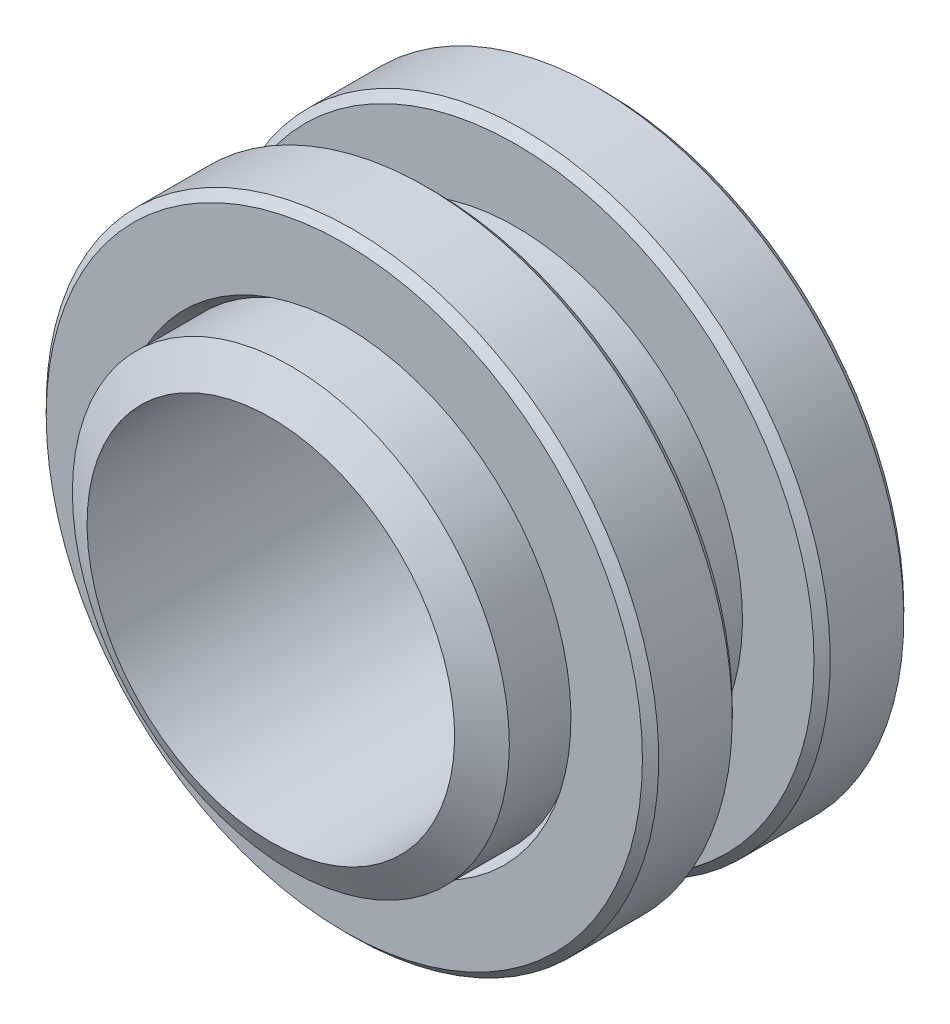
ISO-10303-21;
HEADER;
FILE_DESCRIPTION(('STEP AP214'),'2;1');
FILE_NAME('part.step','',(''),(''),'','','');
FILE_SCHEMA(('AUTOMOTIVE_DESIGN { 1 0 10303 214 1 1 1 1 }'));
ENDSEC;
DATA;
#1=APPLICATION_CONTEXT('core data for automotive mechanical design processes');
#2=APPLICATION_PROTOCOL_DEFINITION('international standard','automotive_design',2000,#1);
#3=PRODUCT_CONTEXT('',#1,'mechanical');
#4=PRODUCT('Part','Part','',(#3));
#5=PRODUCT_RELATED_PRODUCT_CATEGORY('part','',(#4));
#6=PRODUCT_DEFINITION_FORMATION('','',#4);
#7=PRODUCT_DEFINITION_CONTEXT('part definition',#1,'design');
#8=PRODUCT_DEFINITION('design','',#6,#7);
#9=PRODUCT_DEFINITION_SHAPE('','',#8);
#10=(LENGTH_UNIT() NAMED_UNIT(*) SI_UNIT(.MILLI.,.METRE.));
#11=(NAMED_UNIT(*) PLANE_ANGLE_UNIT() SI_UNIT($,.RADIAN.));
#12=(NAMED_UNIT(*) SI_UNIT($,.STERADIAN.) SOLID_ANGLE_UNIT());
#13=UNCERTAINTY_MEASURE_WITH_UNIT(LENGTH_MEASURE(1.E-05),#10,'distance_accuracy_value','');
#14=(GEOMETRIC_REPRESENTATION_CONTEXT(3) GLOBAL_UNCERTAINTY_ASSIGNED_CONTEXT((#13)) GLOBAL_UNIT_ASSIGNED_CONTEXT((#10,
#11,#12)) REPRESENTATION_CONTEXT('',''));
#15=CARTESIAN_POINT('',(0.,0.,0.));
#16=DIRECTION('',(0.,0.,1.));
#17=DIRECTION('',(1.,0.,0.));
#18=AXIS2_PLACEMENT_3D('',#15,#16,#17);
#19=CARTESIAN_POINT('',(0.,0.,1.6627503844098));
#20=DIRECTION('',(0.,0.,-1.));
#21=DIRECTION('',(0.,1.,0.));
#22=AXIS2_PLACEMENT_3D('',#19,#20,#21);
#23=CONICAL_SURFACE('',#22,6.7945,1.0471975511966);
#24=CARTESIAN_POINT('',(0.,0.,2.286));
#25=DIRECTION('',(0.,0.,1.));
#26=DIRECTION('',(0.,-1.,0.));
#27=AXIS2_PLACEMENT_3D('',#24,#25,#26);
#28=CIRCLE('',#27,5.715);
#29=CARTESIAN_POINT('',(0.,-5.715,2.286));
#30=VERTEX_POINT('',#29);
#31=EDGE_CURVE('P0_E10',#30,#30,#28,.T.);
#32=ORIENTED_EDGE('',*,*,#31,.F.);
#33=EDGE_LOOP('',(#32));
#34=FACE_BOUND('',#33,.T.);
#35=CARTESIAN_POINT('',(0.,0.,1.6627503844098));
#36=DIRECTION('',(0.,0.,1.));
#37=DIRECTION('',(0.,-1.,0.));
#38=AXIS2_PLACEMENT_3D('',#35,#36,#37);
#39=CIRCLE('',#38,6.7945);
#40=CARTESIAN_POINT('',(0.,-6.7945,1.6627503844098));
#41=VERTEX_POINT('',#40);
#42=EDGE_CURVE('P0_E28',#41,#41,#39,.T.);
#43=ORIENTED_EDGE('',*,*,#42,.T.);
#44=EDGE_LOOP('',(#43));
#45=FACE_BOUND('',#44,.T.);
#46=ADVANCED_FACE('P0_F14',(#34,#45),#23,.T.);
#47=CARTESIAN_POINT('',(0.,0.,2.286));
#48=DIRECTION('',(0.,0.,1.));
#49=DIRECTION('',(0.,-1.,0.));
#50=AXIS2_PLACEMENT_3D('',#47,#48,#49);
#51=CYLINDRICAL_SURFACE('',#50,5.715);
#52=CARTESIAN_POINT('',(0.,0.,-10.414));
#53=DIRECTION('',(0.,0.,1.));
#54=DIRECTION('',(0.,-1.,0.));
#55=AXIS2_PLACEMENT_3D('',#52,#53,#54);
#56=CIRCLE('',#55,5.715);
#57=CARTESIAN_POINT('',(0.,-5.715,-10.414));
#58=VERTEX_POINT('',#57);
#59=EDGE_CURVE('P0_E20',#58,#58,#56,.T.);
#60=ORIENTED_EDGE('',*,*,#59,.F.);
#61=EDGE_LOOP('',(#60));
#62=FACE_BOUND('',#61,.T.);
#63=ORIENTED_EDGE('',*,*,#31,.T.);
#64=EDGE_LOOP('',(#63));
#65=FACE_BOUND('',#64,.T.);
#66=ADVANCED_FACE('P0_F43',(#62,#65),#51,.F.);
#67=CARTESIAN_POINT('',(0.,0.,-10.414));
#68=DIRECTION('',(0.,0.,1.));
#69=DIRECTION('',(0.,-1.,0.));
#70=AXIS2_PLACEMENT_3D('',#67,#68,#69);
#71=CONICAL_SURFACE('',#70,5.715,1.0471975511966);
#72=CARTESIAN_POINT('',(0.,0.,-9.7907503844098));
#73=DIRECTION('',(0.,0.,1.));
#74=DIRECTION('',(0.,-1.,0.));
#75=AXIS2_PLACEMENT_3D('',#72,#73,#74);
#76=CIRCLE('',#75,6.7945);
#77=CARTESIAN_POINT('',(0.,-6.7945,-9.7907503844098));
#78=VERTEX_POINT('',#77);
#79=EDGE_CURVE('P0_E24',#78,#78,#76,.T.);
#80=ORIENTED_EDGE('',*,*,#79,.F.);
#81=EDGE_LOOP('',(#80));
#82=FACE_BOUND('',#81,.T.);
#83=ORIENTED_EDGE('',*,*,#59,.T.);
#84=EDGE_LOOP('',(#83));
#85=FACE_BOUND('',#84,.T.);
#86=ADVANCED_FACE('P0_F38',(#82,#85),#71,.T.);
#87=CARTESIAN_POINT('',(0.,0.,2.286));
#88=DIRECTION('',(0.,0.,1.));
#89=DIRECTION('',(0.,-1.,0.));
#90=AXIS2_PLACEMENT_3D('',#87,#88,#89);
#91=CYLINDRICAL_SURFACE('',#90,6.7945);
#92=ORIENTED_EDGE('',*,*,#42,.F.);
#93=EDGE_LOOP('',(#92));
#94=FACE_BOUND('',#93,.T.);
#95=ORIENTED_EDGE('',*,*,#79,.T.);
#96=EDGE_LOOP('',(#95));
#97=FACE_BOUND('',#96,.T.);
#98=ADVANCED_FACE('P0_F35',(#94,#97),#91,.T.);
#99=CLOSED_SHELL('',(#46,#66,#86,#98));
#100=MANIFOLD_SOLID_BREP('P0_B1',#99);
#101=CARTESIAN_POINT('',(6.7945,0.,-2.794));
#102=DIRECTION('',(0.,0.,1.));
#103=DIRECTION('',(0.,-1.,0.));
#104=AXIS2_PLACEMENT_3D('',#101,#102,#103);
#105=PLANE('',#104);
#106=CARTESIAN_POINT('',(0.,0.,-2.794));
#107=DIRECTION('',(0.,0.,1.));
#108=DIRECTION('',(0.,-1.,0.));
#109=AXIS2_PLACEMENT_3D('',#106,#107,#108);
#110=CIRCLE('',#109,7.0485);
#111=CARTESIAN_POINT('',(0.,-7.0485,-2.794));
#112=VERTEX_POINT('',#111);
#113=EDGE_CURVE('P1_E29',#112,#112,#110,.T.);
#114=ORIENTED_EDGE('',*,*,#113,.T.);
#115=EDGE_LOOP('',(#114));
#116=FACE_BOUND('',#115,.T.);
#117=CARTESIAN_POINT('',(0.,0.,-2.794));
#118=DIRECTION('',(0.,0.,1.));
#119=DIRECTION('',(0.,-1.,0.));
#120=AXIS2_PLACEMENT_3D('',#117,#118,#119);
#121=CIRCLE('',#120,9.271);
#122=CARTESIAN_POINT('',(0.,-9.271,-2.794));
#123=VERTEX_POINT('',#122);
#124=EDGE_CURVE('P1_E37',#123,#123,#121,.F.);
#125=ORIENTED_EDGE('',*,*,#124,.T.);
#126=EDGE_LOOP('',(#125));
#127=FACE_BOUND('',#126,.T.);
#128=ADVANCED_FACE('P1_F14',(#116,#127),#105,.F.);
#129=CARTESIAN_POINT('',(0.,0.,15.6468869532938));
#130=DIRECTION('',(0.,0.,1.));
#131=DIRECTION('',(0.,-1.,0.));
#132=AXIS2_PLACEMENT_3D('',#129,#130,#131);
#133=CYLINDRICAL_SURFACE('',#132,9.525);
#134=CARTESIAN_POINT('',(0.,0.,-2.54));
#135=DIRECTION('',(0.,0.,1.));
#136=DIRECTION('',(0.,-1.,0.));
#137=AXIS2_PLACEMENT_3D('',#134,#135,#136);
#138=CIRCLE('',#137,9.525);
#139=CARTESIAN_POINT('',(0.,-9.525,-2.54));
#140=VERTEX_POINT('',#139);
#141=EDGE_CURVE('P1_E40',#140,#140,#138,.T.);
#142=ORIENTED_EDGE('',*,*,#141,.T.);
#143=EDGE_LOOP('',(#142));
#144=FACE_BOUND('',#143,.T.);
#145=CARTESIAN_POINT('',(0.,0.,-0.253999999999999));
#146=DIRECTION('',(0.,0.,-1.));
#147=DIRECTION('',(0.,1.,0.));
#148=AXIS2_PLACEMENT_3D('',#145,#146,#147);
#149=CIRCLE('',#148,9.525);
#150=CARTESIAN_POINT('',(0.,9.525,-0.253999999999999));
#151=VERTEX_POINT('',#150);
#152=EDGE_CURVE('P1_E43',#151,#151,#149,.T.);
#153=ORIENTED_EDGE('',*,*,#152,.T.);
#154=EDGE_LOOP('',(#153));
#155=FACE_BOUND('',#154,.T.);
#156=ADVANCED_FACE('P1_F47',(#144,#155),#133,.T.);
#157=CARTESIAN_POINT('',(9.525,0.,0.));
#158=DIRECTION('',(0.,0.,-1.));
#159=DIRECTION('',(0.,1.,0.));
#160=AXIS2_PLACEMENT_3D('',#157,#158,#159);
#161=PLANE('',#160);
#162=CARTESIAN_POINT('',(0.,0.,0.));
#163=DIRECTION('',(0.,0.,-1.));
#164=DIRECTION('',(0.,1.,0.));
#165=AXIS2_PLACEMENT_3D('',#162,#163,#164);
#166=CIRCLE('',#165,7.0485);
#167=CARTESIAN_POINT('',(0.,7.0485,0.));
#168=VERTEX_POINT('',#167);
#169=EDGE_CURVE('P1_E10',#168,#168,#166,.T.);
#170=ORIENTED_EDGE('',*,*,#169,.T.);
#171=EDGE_LOOP('',(#170));
#172=FACE_BOUND('',#171,.T.);
#173=CARTESIAN_POINT('',(0.,0.,0.));
#174=DIRECTION('',(0.,0.,-1.));
#175=DIRECTION('',(0.,1.,0.));
#176=AXIS2_PLACEMENT_3D('',#173,#174,#175);
#177=CIRCLE('',#176,9.271);
#178=CARTESIAN_POINT('',(0.,9.271,0.));
#179=VERTEX_POINT('',#178);
#180=EDGE_CURVE('P1_E34',#179,#179,#177,.F.);
#181=ORIENTED_EDGE('',*,*,#180,.T.);
#182=EDGE_LOOP('',(#181));
#183=FACE_BOUND('',#182,.T.);
#184=ADVANCED_FACE('P1_F57',(#172,#183),#161,.F.);
#185=CARTESIAN_POINT('',(0.,0.,15.6468869532938));
#186=DIRECTION('',(0.,0.,1.));
#187=DIRECTION('',(0.,-1.,0.));
#188=AXIS2_PLACEMENT_3D('',#185,#186,#187);
#189=CYLINDRICAL_SURFACE('',#188,6.7945);
#190=CARTESIAN_POINT('',(0.,0.,-2.3540590948775));
#191=DIRECTION('',(0.,0.,1.));
#192=DIRECTION('',(0.,-1.,0.));
#193=AXIS2_PLACEMENT_3D('',#190,#191,#192);
#194=CIRCLE('',#193,6.7945);
#195=CARTESIAN_POINT('',(0.,-6.7945,-2.3540590948775));
#196=VERTEX_POINT('',#195);
#197=EDGE_CURVE('P1_E21',#196,#196,#194,.F.);
#198=ORIENTED_EDGE('',*,*,#197,.T.);
#199=EDGE_LOOP('',(#198));
#200=FACE_BOUND('',#199,.T.);
#201=CARTESIAN_POINT('',(0.,0.,-0.439940905122503));
#202=DIRECTION('',(0.,0.,-1.));
#203=DIRECTION('',(0.,1.,0.));
#204=AXIS2_PLACEMENT_3D('',#201,#202,#203);
#205=CIRCLE('',#204,6.7945);
#206=CARTESIAN_POINT('',(0.,6.7945,-0.439940905122503));
#207=VERTEX_POINT('',#206);
#208=EDGE_CURVE('P1_E25',#207,#207,#205,.F.);
#209=ORIENTED_EDGE('',*,*,#208,.T.);
#210=EDGE_LOOP('',(#209));
#211=FACE_BOUND('',#210,.T.);
#212=ADVANCED_FACE('P1_F59',(#200,#211),#189,.F.);
#213=CARTESIAN_POINT('',(0.,0.,-2.54));
#214=DIRECTION('',(0.,0.,1.));
#215=DIRECTION('',(0.,-1.,0.));
#216=AXIS2_PLACEMENT_3D('',#213,#214,#215);
#217=CONICAL_SURFACE('',#216,9.525,0.785398163397452);
#218=ORIENTED_EDGE('',*,*,#124,.F.);
#219=EDGE_LOOP('',(#218));
#220=FACE_BOUND('',#219,.T.);
#221=ORIENTED_EDGE('',*,*,#141,.F.);
#222=EDGE_LOOP('',(#221));
#223=FACE_BOUND('',#222,.T.);
#224=ADVANCED_FACE('P1_F53',(#220,#223),#217,.T.);
#225=CARTESIAN_POINT('',(0.,0.,0.));
#226=DIRECTION('',(0.,0.,-1.));
#227=DIRECTION('',(0.,1.,0.));
#228=AXIS2_PLACEMENT_3D('',#225,#226,#227);
#229=CONICAL_SURFACE('',#228,9.271,0.785398163397452);
#230=ORIENTED_EDGE('',*,*,#152,.F.);
#231=EDGE_LOOP('',(#230));
#232=FACE_BOUND('',#231,.T.);
#233=ORIENTED_EDGE('',*,*,#180,.F.);
#234=EDGE_LOOP('',(#233));
#235=FACE_BOUND('',#234,.T.);
#236=ADVANCED_FACE('P1_F49',(#232,#235),#229,.T.);
#237=CARTESIAN_POINT('',(0.,0.,-2.794));
#238=DIRECTION('',(0.,0.,-1.));
#239=DIRECTION('',(0.,1.,0.));
#240=AXIS2_PLACEMENT_3D('',#237,#238,#239);
#241=CONICAL_SURFACE('',#240,7.0485,0.523598775598303);
#242=ORIENTED_EDGE('',*,*,#197,.F.);
#243=EDGE_LOOP('',(#242));
#244=FACE_BOUND('',#243,.T.);
#245=ORIENTED_EDGE('',*,*,#113,.F.);
#246=EDGE_LOOP('',(#245));
#247=FACE_BOUND('',#246,.T.);
#248=ADVANCED_FACE('P1_F52',(#244,#247),#241,.F.);
#249=CARTESIAN_POINT('',(0.,0.,-0.439940905122503));
#250=DIRECTION('',(0.,0.,1.));
#251=DIRECTION('',(0.,-1.,0.));
#252=AXIS2_PLACEMENT_3D('',#249,#250,#251);
#253=CONICAL_SURFACE('',#252,6.7945,0.523598775598297);
#254=ORIENTED_EDGE('',*,*,#169,.F.);
#255=EDGE_LOOP('',(#254));
#256=FACE_BOUND('',#255,.T.);
#257=ORIENTED_EDGE('',*,*,#208,.F.);
#258=EDGE_LOOP('',(#257));
#259=FACE_BOUND('',#258,.T.);
#260=ADVANCED_FACE('P1_F16',(#256,#259),#253,.F.);
#261=CLOSED_SHELL('',(#128,#156,#184,#212,#224,#236,#248,#260));
#262=MANIFOLD_SOLID_BREP('P1_B1',#261);
#263=CARTESIAN_POINT('',(-6.7945,0.,-8.128));
#264=DIRECTION('',(0.,0.,1.));
#265=DIRECTION('',(0.,1.,0.));
#266=AXIS2_PLACEMENT_3D('',#263,#264,#265);
#267=PLANE('',#266);
#268=CARTESIAN_POINT('',(0.,0.,-8.128));
#269=DIRECTION('',(0.,0.,1.));
#270=DIRECTION('',(0.,1.,0.));
#271=AXIS2_PLACEMENT_3D('',#268,#269,#270);
#272=CIRCLE('',#271,7.0485);
#273=CARTESIAN_POINT('',(0.,7.04850000000001,-8.128));
#274=VERTEX_POINT('',#273);
#275=EDGE_CURVE('P2_E29',#274,#274,#272,.T.);
#276=ORIENTED_EDGE('',*,*,#275,.T.);
#277=EDGE_LOOP('',(#276));
#278=FACE_BOUND('',#277,.T.);
#279=CARTESIAN_POINT('',(0.,0.,-8.128));
#280=DIRECTION('',(0.,0.,1.));
#281=DIRECTION('',(0.,1.,0.));
#282=AXIS2_PLACEMENT_3D('',#279,#280,#281);
#283=CIRCLE('',#282,9.271);
#284=CARTESIAN_POINT('',(0.,9.271,-8.128));
#285=VERTEX_POINT('',#284);
#286=EDGE_CURVE('P2_E37',#285,#285,#283,.F.);
#287=ORIENTED_EDGE('',*,*,#286,.T.);
#288=EDGE_LOOP('',(#287));
#289=FACE_BOUND('',#288,.T.);
#290=ADVANCED_FACE('P2_F14',(#278,#289),#267,.F.);
#291=CARTESIAN_POINT('',(0.,0.,10.3128869532938));
#292=DIRECTION('',(0.,0.,1.));
#293=DIRECTION('',(0.,1.,0.));
#294=AXIS2_PLACEMENT_3D('',#291,#292,#293);
#295=CYLINDRICAL_SURFACE('',#294,9.525);
#296=CARTESIAN_POINT('',(0.,0.,-7.874));
#297=DIRECTION('',(0.,0.,1.));
#298=DIRECTION('',(0.,1.,0.));
#299=AXIS2_PLACEMENT_3D('',#296,#297,#298);
#300=CIRCLE('',#299,9.525);
#301=CARTESIAN_POINT('',(0.,9.525,-7.874));
#302=VERTEX_POINT('',#301);
#303=EDGE_CURVE('P2_E40',#302,#302,#300,.T.);
#304=ORIENTED_EDGE('',*,*,#303,.T.);
#305=EDGE_LOOP('',(#304));
#306=FACE_BOUND('',#305,.T.);
#307=CARTESIAN_POINT('',(0.,0.,-5.588));
#308=DIRECTION('',(0.,0.,-1.));
#309=DIRECTION('',(0.,-1.,0.));
#310=AXIS2_PLACEMENT_3D('',#307,#308,#309);
#311=CIRCLE('',#310,9.525);
#312=CARTESIAN_POINT('',(0.,-9.525,-5.588));
#313=VERTEX_POINT('',#312);
#314=EDGE_CURVE('P2_E43',#313,#313,#311,.T.);
#315=ORIENTED_EDGE('',*,*,#314,.T.);
#316=EDGE_LOOP('',(#315));
#317=FACE_BOUND('',#316,.T.);
#318=ADVANCED_FACE('P2_F47',(#306,#317),#295,.T.);
#319=CARTESIAN_POINT('',(-9.525,0.,-5.334));
#320=DIRECTION('',(0.,0.,-1.));
#321=DIRECTION('',(0.,-1.,0.));
#322=AXIS2_PLACEMENT_3D('',#319,#320,#321);
#323=PLANE('',#322);
#324=CARTESIAN_POINT('',(0.,0.,-5.334));
#325=DIRECTION('',(0.,0.,-1.));
#326=DIRECTION('',(0.,-1.,0.));
#327=AXIS2_PLACEMENT_3D('',#324,#325,#326);
#328=CIRCLE('',#327,7.0485);
#329=CARTESIAN_POINT('',(0.,-7.04850000000001,-5.334));
#330=VERTEX_POINT('',#329);
#331=EDGE_CURVE('P2_E10',#330,#330,#328,.T.);
#332=ORIENTED_EDGE('',*,*,#331,.T.);
#333=EDGE_LOOP('',(#332));
#334=FACE_BOUND('',#333,.T.);
#335=CARTESIAN_POINT('',(0.,0.,-5.334));
#336=DIRECTION('',(0.,0.,-1.));
#337=DIRECTION('',(0.,-1.,0.));
#338=AXIS2_PLACEMENT_3D('',#335,#336,#337);
#339=CIRCLE('',#338,9.271);
#340=CARTESIAN_POINT('',(0.,-9.271,-5.334));
#341=VERTEX_POINT('',#340);
#342=EDGE_CURVE('P2_E34',#341,#341,#339,.F.);
#343=ORIENTED_EDGE('',*,*,#342,.T.);
#344=EDGE_LOOP('',(#343));
#345=FACE_BOUND('',#344,.T.);
#346=ADVANCED_FACE('P2_F57',(#334,#345),#323,.F.);
#347=CARTESIAN_POINT('',(0.,0.,10.3128869532938));
#348=DIRECTION('',(0.,0.,1.));
#349=DIRECTION('',(0.,1.,0.));
#350=AXIS2_PLACEMENT_3D('',#347,#348,#349);
#351=CYLINDRICAL_SURFACE('',#350,6.7945);
#352=CARTESIAN_POINT('',(0.,0.,-7.6880590948775));
#353=DIRECTION('',(0.,0.,1.));
#354=DIRECTION('',(0.,1.,0.));
#355=AXIS2_PLACEMENT_3D('',#352,#353,#354);
#356=CIRCLE('',#355,6.7945);
#357=CARTESIAN_POINT('',(0.,6.7945,-7.6880590948775));
#358=VERTEX_POINT('',#357);
#359=EDGE_CURVE('P2_E21',#358,#358,#356,.F.);
#360=ORIENTED_EDGE('',*,*,#359,.T.);
#361=EDGE_LOOP('',(#360));
#362=FACE_BOUND('',#361,.T.);
#363=CARTESIAN_POINT('',(0.,0.,-5.7739409051225));
#364=DIRECTION('',(0.,0.,-1.));
#365=DIRECTION('',(0.,-1.,0.));
#366=AXIS2_PLACEMENT_3D('',#363,#364,#365);
#367=CIRCLE('',#366,6.7945);
#368=CARTESIAN_POINT('',(0.,-6.7945,-5.7739409051225));
#369=VERTEX_POINT('',#368);
#370=EDGE_CURVE('P2_E25',#369,#369,#367,.F.);
#371=ORIENTED_EDGE('',*,*,#370,.T.);
#372=EDGE_LOOP('',(#371));
#373=FACE_BOUND('',#372,.T.);
#374=ADVANCED_FACE('P2_F59',(#362,#373),#351,.F.);
#375=CARTESIAN_POINT('',(0.,0.,-7.874));
#376=DIRECTION('',(0.,0.,1.));
#377=DIRECTION('',(0.,1.,0.));
#378=AXIS2_PLACEMENT_3D('',#375,#376,#377);
#379=CONICAL_SURFACE('',#378,9.525,0.785398163397452);
#380=ORIENTED_EDGE('',*,*,#286,.F.);
#381=EDGE_LOOP('',(#380));
#382=FACE_BOUND('',#381,.T.);
#383=ORIENTED_EDGE('',*,*,#303,.F.);
#384=EDGE_LOOP('',(#383));
#385=FACE_BOUND('',#384,.T.);
#386=ADVANCED_FACE('P2_F53',(#382,#385),#379,.T.);
#387=CARTESIAN_POINT('',(0.,0.,-5.334));
#388=DIRECTION('',(0.,0.,-1.));
#389=DIRECTION('',(0.,-1.,0.));
#390=AXIS2_PLACEMENT_3D('',#387,#388,#389);
#391=CONICAL_SURFACE('',#390,9.271,0.785398163397452);
#392=ORIENTED_EDGE('',*,*,#314,.F.);
#393=EDGE_LOOP('',(#392));
#394=FACE_BOUND('',#393,.T.);
#395=ORIENTED_EDGE('',*,*,#342,.F.);
#396=EDGE_LOOP('',(#395));
#397=FACE_BOUND('',#396,.T.);
#398=ADVANCED_FACE('P2_F49',(#394,#397),#391,.T.);
#399=CARTESIAN_POINT('',(0.,0.,-8.128));
#400=DIRECTION('',(0.,0.,-1.));
#401=DIRECTION('',(0.,-1.,0.));
#402=AXIS2_PLACEMENT_3D('',#399,#400,#401);
#403=CONICAL_SURFACE('',#402,7.0485,0.523598775598303);
#404=ORIENTED_EDGE('',*,*,#359,.F.);
#405=EDGE_LOOP('',(#404));
#406=FACE_BOUND('',#405,.T.);
#407=ORIENTED_EDGE('',*,*,#275,.F.);
#408=EDGE_LOOP('',(#407));
#409=FACE_BOUND('',#408,.T.);
#410=ADVANCED_FACE('P2_F52',(#406,#409),#403,.F.);
#411=CARTESIAN_POINT('',(0.,0.,-5.7739409051225));
#412=DIRECTION('',(0.,0.,1.));
#413=DIRECTION('',(0.,1.,0.));
#414=AXIS2_PLACEMENT_3D('',#411,#412,#413);
#415=CONICAL_SURFACE('',#414,6.7945,0.523598775598297);
#416=ORIENTED_EDGE('',*,*,#331,.F.);
#417=EDGE_LOOP('',(#416));
#418=FACE_BOUND('',#417,.T.);
#419=ORIENTED_EDGE('',*,*,#370,.F.);
#420=EDGE_LOOP('',(#419));
#421=FACE_BOUND('',#420,.T.);
#422=ADVANCED_FACE('P2_F16',(#418,#421),#415,.F.);
#423=CLOSED_SHELL('',(#290,#318,#346,#374,#386,#398,#410,#422));
#424=MANIFOLD_SOLID_BREP('P2_B1',#423);
#425=ADVANCED_BREP_SHAPE_REPRESENTATION('',(#18,#100,#262,#424),#14);
#426=SHAPE_DEFINITION_REPRESENTATION(#9,#425);
ENDSEC;
END-ISO-10303-21;
